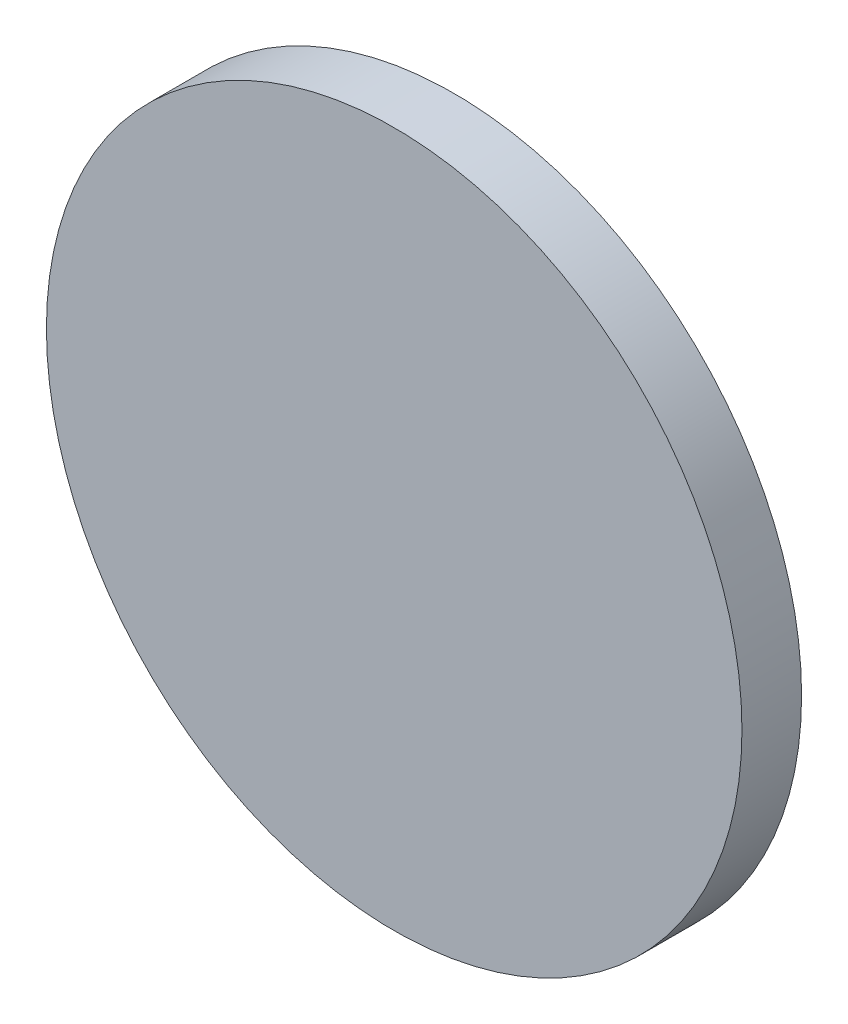
ISO-10303-21;
HEADER;
FILE_DESCRIPTION(('STEP AP214'),'2;1');
FILE_NAME('part.step','',(''),(''),'','','');
FILE_SCHEMA(('AUTOMOTIVE_DESIGN { 1 0 10303 214 1 1 1 1 }'));
ENDSEC;
DATA;
#1=APPLICATION_CONTEXT('core data for automotive mechanical design processes');
#2=APPLICATION_PROTOCOL_DEFINITION('international standard','automotive_design',2000,#1);
#3=PRODUCT_CONTEXT('',#1,'mechanical');
#4=PRODUCT('Part','Part','',(#3));
#5=PRODUCT_RELATED_PRODUCT_CATEGORY('part','',(#4));
#6=PRODUCT_DEFINITION_FORMATION('','',#4);
#7=PRODUCT_DEFINITION_CONTEXT('part definition',#1,'design');
#8=PRODUCT_DEFINITION('design','',#6,#7);
#9=PRODUCT_DEFINITION_SHAPE('','',#8);
#10=(LENGTH_UNIT() NAMED_UNIT(*) SI_UNIT(.MILLI.,.METRE.));
#11=(NAMED_UNIT(*) PLANE_ANGLE_UNIT() SI_UNIT($,.RADIAN.));
#12=(NAMED_UNIT(*) SI_UNIT($,.STERADIAN.) SOLID_ANGLE_UNIT());
#13=UNCERTAINTY_MEASURE_WITH_UNIT(LENGTH_MEASURE(1.E-05),#10,'distance_accuracy_value','');
#14=(GEOMETRIC_REPRESENTATION_CONTEXT(3) GLOBAL_UNCERTAINTY_ASSIGNED_CONTEXT((#13)) GLOBAL_UNIT_ASSIGNED_CONTEXT((#10,
#11,#12)) REPRESENTATION_CONTEXT('',''));
#15=CARTESIAN_POINT('',(0.,0.,0.));
#16=DIRECTION('',(0.,0.,1.));
#17=DIRECTION('',(1.,0.,0.));
#18=AXIS2_PLACEMENT_3D('',#15,#16,#17);
#19=CARTESIAN_POINT('',(11.576,9.760000014875,0.76487));
#20=DIRECTION('',(0.,0.,-1.));
#21=DIRECTION('',(-1.,0.,0.));
#22=AXIS2_PLACEMENT_3D('',#19,#20,#21);
#23=PLANE('',#22);
#24=CARTESIAN_POINT('',(11.576,9.760000014875,0.76487));
#25=DIRECTION('',(0.,0.,1.));
#26=DIRECTION('',(1.,0.,0.));
#27=AXIS2_PLACEMENT_3D('',#24,#25,#26);
#28=CIRCLE('',#27,0.200024667);
#29=CARTESIAN_POINT('',(11.776024667,9.760000014875,0.76487));
#30=VERTEX_POINT('',#29);
#31=EDGE_CURVE('E18',#30,#30,#28,.T.);
#32=ORIENTED_EDGE('',*,*,#31,.F.);
#33=EDGE_LOOP('',(#32));
#34=FACE_BOUND('',#33,.T.);
#35=ADVANCED_FACE('F15',(#34),#23,.T.);
#36=CARTESIAN_POINT('',(11.576,9.760000014875,0.76487));
#37=DIRECTION('',(0.,0.,1.));
#38=DIRECTION('',(1.,0.,0.));
#39=AXIS2_PLACEMENT_3D('',#36,#37,#38);
#40=CYLINDRICAL_SURFACE('',#39,0.200024667);
#41=CARTESIAN_POINT('',(11.576,9.760000014875,0.79916));
#42=DIRECTION('',(0.,0.,1.));
#43=DIRECTION('',(1.,0.,0.));
#44=AXIS2_PLACEMENT_3D('',#41,#42,#43);
#45=CIRCLE('',#44,0.200024667);
#46=CARTESIAN_POINT('',(11.776024667,9.760000014875,0.79916));
#47=VERTEX_POINT('',#46);
#48=EDGE_CURVE('E10',#47,#47,#45,.T.);
#49=ORIENTED_EDGE('',*,*,#48,.F.);
#50=EDGE_LOOP('',(#49));
#51=FACE_BOUND('',#50,.T.);
#52=ORIENTED_EDGE('',*,*,#31,.T.);
#53=EDGE_LOOP('',(#52));
#54=FACE_BOUND('',#53,.T.);
#55=ADVANCED_FACE('F27',(#51,#54),#40,.T.);
#56=CARTESIAN_POINT('',(11.576,9.760000014875,0.79916));
#57=DIRECTION('',(0.,0.,1.));
#58=DIRECTION('',(1.,0.,0.));
#59=AXIS2_PLACEMENT_3D('',#56,#57,#58);
#60=PLANE('',#59);
#61=ORIENTED_EDGE('',*,*,#48,.T.);
#62=EDGE_LOOP('',(#61));
#63=FACE_BOUND('',#62,.T.);
#64=ADVANCED_FACE('F34',(#63),#60,.T.);
#65=CLOSED_SHELL('',(#35,#55,#64));
#66=MANIFOLD_SOLID_BREP('B1',#65);
#67=ADVANCED_BREP_SHAPE_REPRESENTATION('',(#18,#66),#14);
#68=SHAPE_DEFINITION_REPRESENTATION(#9,#67);
ENDSEC;
END-ISO-10303-21;
